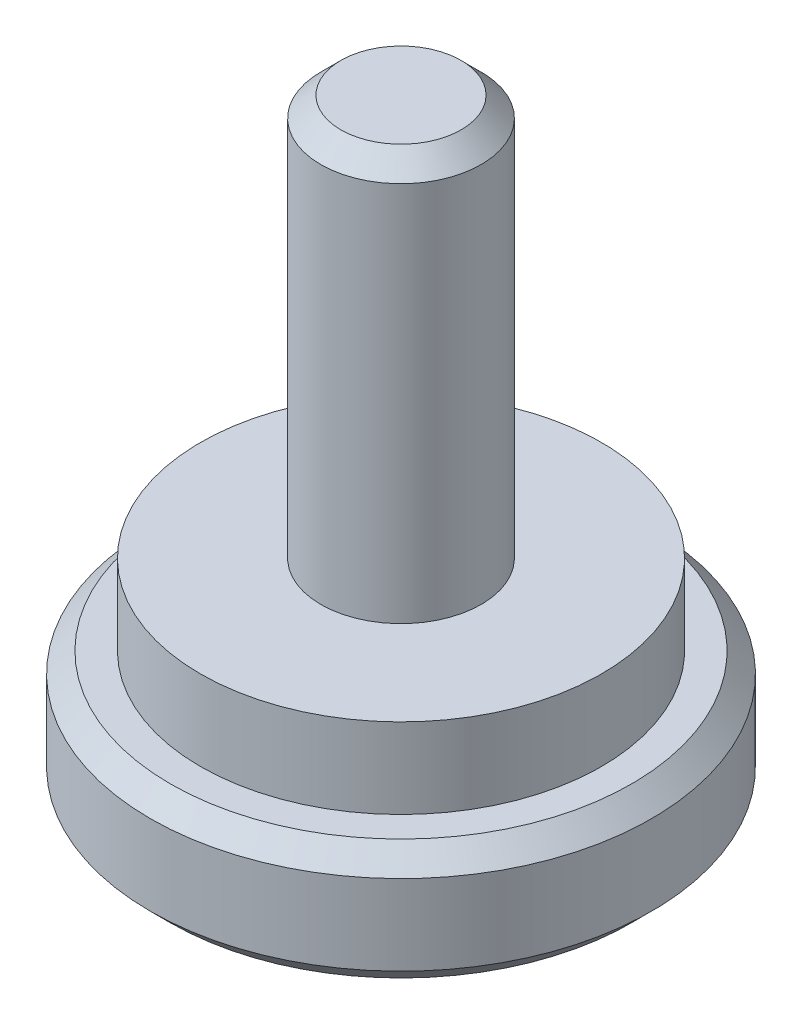
ISO-10303-21;
HEADER;
FILE_DESCRIPTION(('STEP AP214'),'2;1');
FILE_NAME('part.step','',(''),(''),'','','');
FILE_SCHEMA(('AUTOMOTIVE_DESIGN { 1 0 10303 214 1 1 1 1 }'));
ENDSEC;
DATA;
#1=APPLICATION_CONTEXT('core data for automotive mechanical design processes');
#2=APPLICATION_PROTOCOL_DEFINITION('international standard','automotive_design',2000,#1);
#3=PRODUCT_CONTEXT('',#1,'mechanical');
#4=PRODUCT('Part','Part','',(#3));
#5=PRODUCT_RELATED_PRODUCT_CATEGORY('part','',(#4));
#6=PRODUCT_DEFINITION_FORMATION('','',#4);
#7=PRODUCT_DEFINITION_CONTEXT('part definition',#1,'design');
#8=PRODUCT_DEFINITION('design','',#6,#7);
#9=PRODUCT_DEFINITION_SHAPE('','',#8);
#10=(LENGTH_UNIT() NAMED_UNIT(*) SI_UNIT(.MILLI.,.METRE.));
#11=(NAMED_UNIT(*) PLANE_ANGLE_UNIT() SI_UNIT($,.RADIAN.));
#12=(NAMED_UNIT(*) SI_UNIT($,.STERADIAN.) SOLID_ANGLE_UNIT());
#13=UNCERTAINTY_MEASURE_WITH_UNIT(LENGTH_MEASURE(1.E-05),#10,'distance_accuracy_value','');
#14=(GEOMETRIC_REPRESENTATION_CONTEXT(3) GLOBAL_UNCERTAINTY_ASSIGNED_CONTEXT((#13)) GLOBAL_UNIT_ASSIGNED_CONTEXT((#10,
#11,#12)) REPRESENTATION_CONTEXT('',''));
#15=CARTESIAN_POINT('',(0.,0.,0.));
#16=DIRECTION('',(0.,0.,1.));
#17=DIRECTION('',(1.,0.,0.));
#18=AXIS2_PLACEMENT_3D('',#15,#16,#17);
#19=CARTESIAN_POINT('',(0.,5.,0.));
#20=DIRECTION('',(0.,1.,0.));
#21=DIRECTION('',(0.,0.,1.));
#22=AXIS2_PLACEMENT_3D('',#19,#20,#21);
#23=PLANE('',#22);
#24=CARTESIAN_POINT('',(0.,5.,0.));
#25=DIRECTION('',(0.,1.,0.));
#26=DIRECTION('',(0.,0.,1.));
#27=AXIS2_PLACEMENT_3D('',#24,#25,#26);
#28=CIRCLE('',#27,5.);
#29=CARTESIAN_POINT('',(0.,5.,5.));
#30=VERTEX_POINT('',#29);
#31=EDGE_CURVE('E141',#30,#30,#28,.T.);
#32=ORIENTED_EDGE('',*,*,#31,.T.);
#33=EDGE_LOOP('',(#32));
#34=FACE_BOUND('',#33,.T.);
#35=CARTESIAN_POINT('',(0.,5.,0.));
#36=DIRECTION('',(0.,1.,0.));
#37=DIRECTION('',(0.,0.,1.));
#38=AXIS2_PLACEMENT_3D('',#35,#36,#37);
#39=CIRCLE('',#38,2.);
#40=CARTESIAN_POINT('',(0.,5.,2.));
#41=VERTEX_POINT('',#40);
#42=EDGE_CURVE('E132',#41,#41,#39,.T.);
#43=ORIENTED_EDGE('',*,*,#42,.F.);
#44=EDGE_LOOP('',(#43));
#45=FACE_BOUND('',#44,.T.);
#46=ADVANCED_FACE('F30',(#34,#45),#23,.T.);
#47=CARTESIAN_POINT('',(0.,3.,0.));
#48=DIRECTION('',(0.,1.,0.));
#49=DIRECTION('',(0.,0.,1.));
#50=AXIS2_PLACEMENT_3D('',#47,#48,#49);
#51=PLANE('',#50);
#52=CARTESIAN_POINT('',(0.,3.,0.));
#53=DIRECTION('',(0.,1.,0.));
#54=DIRECTION('',(0.,0.,1.));
#55=AXIS2_PLACEMENT_3D('',#52,#53,#54);
#56=CIRCLE('',#55,5.75);
#57=CARTESIAN_POINT('',(0.,3.,5.75));
#58=VERTEX_POINT('',#57);
#59=EDGE_CURVE('E144',#58,#58,#56,.T.);
#60=ORIENTED_EDGE('',*,*,#59,.T.);
#61=EDGE_LOOP('',(#60));
#62=FACE_BOUND('',#61,.T.);
#63=CARTESIAN_POINT('',(0.,3.,0.));
#64=DIRECTION('',(0.,1.,0.));
#65=DIRECTION('',(0.,0.,1.));
#66=AXIS2_PLACEMENT_3D('',#63,#64,#65);
#67=CIRCLE('',#66,5.);
#68=CARTESIAN_POINT('',(0.,3.,5.));
#69=VERTEX_POINT('',#68);
#70=EDGE_CURVE('E140',#69,#69,#67,.T.);
#71=ORIENTED_EDGE('',*,*,#70,.F.);
#72=EDGE_LOOP('',(#71));
#73=FACE_BOUND('',#72,.T.);
#74=ADVANCED_FACE('F176',(#62,#73),#51,.T.);
#75=CARTESIAN_POINT('',(0.,3.,0.));
#76=DIRECTION('',(0.,-1.,0.));
#77=DIRECTION('',(0.,0.,-1.));
#78=AXIS2_PLACEMENT_3D('',#75,#76,#77);
#79=CYLINDRICAL_SURFACE('',#78,6.25);
#80=CARTESIAN_POINT('',(0.,2.5,0.));
#81=DIRECTION('',(0.,1.,0.));
#82=DIRECTION('',(0.,0.,1.));
#83=AXIS2_PLACEMENT_3D('',#80,#81,#82);
#84=CIRCLE('',#83,6.25);
#85=CARTESIAN_POINT('',(0.,2.5,6.25));
#86=VERTEX_POINT('',#85);
#87=EDGE_CURVE('E152',#86,#86,#84,.F.);
#88=ORIENTED_EDGE('',*,*,#87,.T.);
#89=EDGE_LOOP('',(#88));
#90=FACE_BOUND('',#89,.T.);
#91=CARTESIAN_POINT('',(0.,0.499999999999997,0.));
#92=DIRECTION('',(0.,1.,0.));
#93=DIRECTION('',(0.,0.,1.));
#94=AXIS2_PLACEMENT_3D('',#91,#92,#93);
#95=CIRCLE('',#94,6.25);
#96=CARTESIAN_POINT('',(0.,0.499999999999997,6.25));
#97=VERTEX_POINT('',#96);
#98=EDGE_CURVE('E149',#97,#97,#95,.T.);
#99=ORIENTED_EDGE('',*,*,#98,.T.);
#100=EDGE_LOOP('',(#99));
#101=FACE_BOUND('',#100,.T.);
#102=ADVANCED_FACE('F182',(#90,#101),#79,.T.);
#103=CARTESIAN_POINT('',(0.,0.,0.));
#104=DIRECTION('',(0.,1.,0.));
#105=DIRECTION('',(0.,0.,1.));
#106=AXIS2_PLACEMENT_3D('',#103,#104,#105);
#107=PLANE('',#106);
#108=DIRECTION('',(-0.866025403784439,0.,-0.5));
#109=VECTOR('',#108,1.);
#110=CARTESIAN_POINT('',(0.,0.,2.3094010767585));
#111=LINE('',#110,#109);
#112=CARTESIAN_POINT('',(0.,0.,2.3094010767585));
#113=VERTEX_POINT('',#112);
#114=CARTESIAN_POINT('',(-2.,0.,1.15470053837925));
#115=VERTEX_POINT('',#114);
#116=EDGE_CURVE('E119',#113,#115,#111,.T.);
#117=ORIENTED_EDGE('',*,*,#116,.F.);
#118=DIRECTION('',(-0.866025403784439,0.,0.5));
#119=VECTOR('',#118,1.);
#120=CARTESIAN_POINT('',(2.,0.,1.15470053837925));
#121=LINE('',#120,#119);
#122=CARTESIAN_POINT('',(2.,0.,1.15470053837925));
#123=VERTEX_POINT('',#122);
#124=EDGE_CURVE('E45',#123,#113,#121,.T.);
#125=ORIENTED_EDGE('',*,*,#124,.F.);
#126=DIRECTION('',(0.,0.,1.));
#127=VECTOR('',#126,1.);
#128=CARTESIAN_POINT('',(2.,0.,-1.15470053837925));
#129=LINE('',#128,#127);
#130=CARTESIAN_POINT('',(2.,0.,-1.15470053837925));
#131=VERTEX_POINT('',#130);
#132=EDGE_CURVE('E128',#131,#123,#129,.T.);
#133=ORIENTED_EDGE('',*,*,#132,.F.);
#134=DIRECTION('',(0.866025403784439,0.,0.5));
#135=VECTOR('',#134,1.);
#136=CARTESIAN_POINT('',(0.,0.,-2.3094010767585));
#137=LINE('',#136,#135);
#138=CARTESIAN_POINT('',(0.,0.,-2.3094010767585));
#139=VERTEX_POINT('',#138);
#140=EDGE_CURVE('E126',#139,#131,#137,.T.);
#141=ORIENTED_EDGE('',*,*,#140,.F.);
#142=DIRECTION('',(0.866025403784439,0.,-0.5));
#143=VECTOR('',#142,1.);
#144=CARTESIAN_POINT('',(-2.,0.,-1.15470053837925));
#145=LINE('',#144,#143);
#146=CARTESIAN_POINT('',(-2.,0.,-1.15470053837925));
#147=VERTEX_POINT('',#146);
#148=EDGE_CURVE('E93',#147,#139,#145,.T.);
#149=ORIENTED_EDGE('',*,*,#148,.F.);
#150=DIRECTION('',(0.,0.,-1.));
#151=VECTOR('',#150,1.);
#152=CARTESIAN_POINT('',(-2.,0.,1.15470053837925));
#153=LINE('',#152,#151);
#154=EDGE_CURVE('E122',#115,#147,#153,.T.);
#155=ORIENTED_EDGE('',*,*,#154,.F.);
#156=EDGE_LOOP('',(#117,#125,#133,#141,#149,#155));
#157=FACE_BOUND('',#156,.T.);
#158=CARTESIAN_POINT('',(0.,0.,0.));
#159=DIRECTION('',(0.,1.,0.));
#160=DIRECTION('',(0.,0.,1.));
#161=AXIS2_PLACEMENT_3D('',#158,#159,#160);
#162=CIRCLE('',#161,5.75);
#163=CARTESIAN_POINT('',(0.,0.,5.75));
#164=VERTEX_POINT('',#163);
#165=EDGE_CURVE('E155',#164,#164,#162,.F.);
#166=ORIENTED_EDGE('',*,*,#165,.T.);
#167=EDGE_LOOP('',(#166));
#168=FACE_BOUND('',#167,.T.);
#169=ADVANCED_FACE('F192',(#157,#168),#107,.F.);
#170=CARTESIAN_POINT('',(0.,5.,0.));
#171=DIRECTION('',(0.,-1.,0.));
#172=DIRECTION('',(0.,0.,-1.));
#173=AXIS2_PLACEMENT_3D('',#170,#171,#172);
#174=CYLINDRICAL_SURFACE('',#173,5.);
#175=ORIENTED_EDGE('',*,*,#31,.F.);
#176=EDGE_LOOP('',(#175));
#177=FACE_BOUND('',#176,.T.);
#178=ORIENTED_EDGE('',*,*,#70,.T.);
#179=EDGE_LOOP('',(#178));
#180=FACE_BOUND('',#179,.T.);
#181=ADVANCED_FACE('F190',(#177,#180),#174,.T.);
#182=CARTESIAN_POINT('',(0.,15.,0.));
#183=DIRECTION('',(0.,-1.,0.));
#184=DIRECTION('',(0.,0.,-1.));
#185=AXIS2_PLACEMENT_3D('',#182,#183,#184);
#186=CYLINDRICAL_SURFACE('',#185,2.);
#187=CARTESIAN_POINT('',(0.,14.5,0.));
#188=DIRECTION('',(0.,1.,0.));
#189=DIRECTION('',(0.,0.,1.));
#190=AXIS2_PLACEMENT_3D('',#187,#188,#189);
#191=CIRCLE('',#190,2.);
#192=CARTESIAN_POINT('',(0.,14.5,2.));
#193=VERTEX_POINT('',#192);
#194=EDGE_CURVE('E11',#193,#193,#191,.F.);
#195=ORIENTED_EDGE('',*,*,#194,.T.);
#196=EDGE_LOOP('',(#195));
#197=FACE_BOUND('',#196,.T.);
#198=ORIENTED_EDGE('',*,*,#42,.T.);
#199=EDGE_LOOP('',(#198));
#200=FACE_BOUND('',#199,.T.);
#201=ADVANCED_FACE('F188',(#197,#200),#186,.T.);
#202=CARTESIAN_POINT('',(0.,15.,0.));
#203=DIRECTION('',(0.,1.,0.));
#204=DIRECTION('',(0.,0.,1.));
#205=AXIS2_PLACEMENT_3D('',#202,#203,#204);
#206=PLANE('',#205);
#207=CARTESIAN_POINT('',(0.,15.,0.));
#208=DIRECTION('',(0.,1.,0.));
#209=DIRECTION('',(0.,0.,1.));
#210=AXIS2_PLACEMENT_3D('',#207,#208,#209);
#211=CIRCLE('',#210,1.5);
#212=CARTESIAN_POINT('',(0.,15.,1.5));
#213=VERTEX_POINT('',#212);
#214=EDGE_CURVE('E38',#213,#213,#211,.T.);
#215=ORIENTED_EDGE('',*,*,#214,.T.);
#216=EDGE_LOOP('',(#215));
#217=FACE_BOUND('',#216,.T.);
#218=ADVANCED_FACE('F160',(#217),#206,.T.);
#219=CARTESIAN_POINT('',(0.,3.,0.));
#220=DIRECTION('',(0.,-1.,0.));
#221=DIRECTION('',(0.,0.,-1.));
#222=AXIS2_PLACEMENT_3D('',#219,#220,#221);
#223=CONICAL_SURFACE('',#222,5.75,0.785398163397445);
#224=ORIENTED_EDGE('',*,*,#87,.F.);
#225=EDGE_LOOP('',(#224));
#226=FACE_BOUND('',#225,.T.);
#227=ORIENTED_EDGE('',*,*,#59,.F.);
#228=EDGE_LOOP('',(#227));
#229=FACE_BOUND('',#228,.T.);
#230=ADVANCED_FACE('F172',(#226,#229),#223,.T.);
#231=CARTESIAN_POINT('',(0.,0.499999999999997,0.));
#232=DIRECTION('',(0.,1.,0.));
#233=DIRECTION('',(0.,0.,1.));
#234=AXIS2_PLACEMENT_3D('',#231,#232,#233);
#235=CONICAL_SURFACE('',#234,6.25,0.785398163397454);
#236=ORIENTED_EDGE('',*,*,#165,.F.);
#237=EDGE_LOOP('',(#236));
#238=FACE_BOUND('',#237,.T.);
#239=ORIENTED_EDGE('',*,*,#98,.F.);
#240=EDGE_LOOP('',(#239));
#241=FACE_BOUND('',#240,.T.);
#242=ADVANCED_FACE('F164',(#238,#241),#235,.T.);
#243=CARTESIAN_POINT('',(0.,15.,0.));
#244=DIRECTION('',(0.,-1.,0.));
#245=DIRECTION('',(0.,0.,-1.));
#246=AXIS2_PLACEMENT_3D('',#243,#244,#245);
#247=CONICAL_SURFACE('',#246,1.5,0.785398163397445);
#248=ORIENTED_EDGE('',*,*,#194,.F.);
#249=EDGE_LOOP('',(#248));
#250=FACE_BOUND('',#249,.T.);
#251=ORIENTED_EDGE('',*,*,#214,.F.);
#252=EDGE_LOOP('',(#251));
#253=FACE_BOUND('',#252,.T.);
#254=ADVANCED_FACE('F32',(#250,#253),#247,.T.);
#255=CARTESIAN_POINT('',(2.,4.,1.15470053837925));
#256=DIRECTION('',(0.5,0.,0.866025403784439));
#257=DIRECTION('',(0.866025403784439,0.,-0.5));
#258=AXIS2_PLACEMENT_3D('',#255,#256,#257);
#259=PLANE('',#258);
#260=ORIENTED_EDGE('',*,*,#124,.T.);
#261=DIRECTION('',(0.,-1.,0.));
#262=VECTOR('',#261,1.);
#263=CARTESIAN_POINT('',(0.,4.,2.3094010767585));
#264=LINE('',#263,#262);
#265=CARTESIAN_POINT('',(0.,4.,2.3094010767585));
#266=VERTEX_POINT('',#265);
#267=EDGE_CURVE('E75',#266,#113,#264,.T.);
#268=ORIENTED_EDGE('',*,*,#267,.F.);
#269=DIRECTION('',(-0.866025403784439,0.,0.5));
#270=VECTOR('',#269,1.);
#271=CARTESIAN_POINT('',(2.,4.,1.15470053837925));
#272=LINE('',#271,#270);
#273=CARTESIAN_POINT('',(2.,4.,1.15470053837925));
#274=VERTEX_POINT('',#273);
#275=EDGE_CURVE('E130',#274,#266,#272,.T.);
#276=ORIENTED_EDGE('',*,*,#275,.F.);
#277=DIRECTION('',(0.,-1.,0.));
#278=VECTOR('',#277,1.);
#279=CARTESIAN_POINT('',(2.,4.,1.15470053837925));
#280=LINE('',#279,#278);
#281=EDGE_CURVE('E53',#274,#123,#280,.T.);
#282=ORIENTED_EDGE('',*,*,#281,.T.);
#283=EDGE_LOOP('',(#260,#268,#276,#282));
#284=FACE_BOUND('',#283,.T.);
#285=ADVANCED_FACE('F163',(#284),#259,.F.);
#286=CARTESIAN_POINT('',(2.,4.,-1.15470053837925));
#287=DIRECTION('',(1.,0.,0.));
#288=DIRECTION('',(0.,0.,-1.));
#289=AXIS2_PLACEMENT_3D('',#286,#287,#288);
#290=PLANE('',#289);
#291=ORIENTED_EDGE('',*,*,#132,.T.);
#292=ORIENTED_EDGE('',*,*,#281,.F.);
#293=DIRECTION('',(0.,0.,1.));
#294=VECTOR('',#293,1.);
#295=CARTESIAN_POINT('',(2.,4.,-1.15470053837925));
#296=LINE('',#295,#294);
#297=CARTESIAN_POINT('',(2.,4.,-1.15470053837925));
#298=VERTEX_POINT('',#297);
#299=EDGE_CURVE('E105',#298,#274,#296,.T.);
#300=ORIENTED_EDGE('',*,*,#299,.F.);
#301=DIRECTION('',(0.,-1.,0.));
#302=VECTOR('',#301,1.);
#303=CARTESIAN_POINT('',(2.,4.,-1.15470053837925));
#304=LINE('',#303,#302);
#305=EDGE_CURVE('E97',#298,#131,#304,.T.);
#306=ORIENTED_EDGE('',*,*,#305,.T.);
#307=EDGE_LOOP('',(#291,#292,#300,#306));
#308=FACE_BOUND('',#307,.T.);
#309=ADVANCED_FACE('F170',(#308),#290,.F.);
#310=CARTESIAN_POINT('',(0.,4.,-2.3094010767585));
#311=DIRECTION('',(0.5,0.,-0.866025403784439));
#312=DIRECTION('',(-0.866025403784439,0.,-0.5));
#313=AXIS2_PLACEMENT_3D('',#310,#311,#312);
#314=PLANE('',#313);
#315=ORIENTED_EDGE('',*,*,#140,.T.);
#316=ORIENTED_EDGE('',*,*,#305,.F.);
#317=DIRECTION('',(0.866025403784439,0.,0.5));
#318=VECTOR('',#317,1.);
#319=CARTESIAN_POINT('',(0.,4.,-2.3094010767585));
#320=LINE('',#319,#318);
#321=CARTESIAN_POINT('',(0.,4.,-2.3094010767585));
#322=VERTEX_POINT('',#321);
#323=EDGE_CURVE('E101',#322,#298,#320,.T.);
#324=ORIENTED_EDGE('',*,*,#323,.F.);
#325=DIRECTION('',(0.,-1.,0.));
#326=VECTOR('',#325,1.);
#327=CARTESIAN_POINT('',(0.,4.,-2.3094010767585));
#328=LINE('',#327,#326);
#329=EDGE_CURVE('E86',#322,#139,#328,.T.);
#330=ORIENTED_EDGE('',*,*,#329,.T.);
#331=EDGE_LOOP('',(#315,#316,#324,#330));
#332=FACE_BOUND('',#331,.T.);
#333=ADVANCED_FACE('F102',(#332),#314,.F.);
#334=CARTESIAN_POINT('',(-2.,4.,-1.15470053837925));
#335=DIRECTION('',(-0.5,0.,-0.866025403784439));
#336=DIRECTION('',(-0.866025403784439,0.,0.5));
#337=AXIS2_PLACEMENT_3D('',#334,#335,#336);
#338=PLANE('',#337);
#339=ORIENTED_EDGE('',*,*,#148,.T.);
#340=ORIENTED_EDGE('',*,*,#329,.F.);
#341=DIRECTION('',(0.866025403784439,0.,-0.5));
#342=VECTOR('',#341,1.);
#343=CARTESIAN_POINT('',(-2.,4.,-1.15470053837925));
#344=LINE('',#343,#342);
#345=CARTESIAN_POINT('',(-2.,4.,-1.15470053837925));
#346=VERTEX_POINT('',#345);
#347=EDGE_CURVE('E90',#346,#322,#344,.T.);
#348=ORIENTED_EDGE('',*,*,#347,.F.);
#349=DIRECTION('',(0.,-1.,0.));
#350=VECTOR('',#349,1.);
#351=CARTESIAN_POINT('',(-2.,4.,-1.15470053837925));
#352=LINE('',#351,#350);
#353=EDGE_CURVE('E98',#346,#147,#352,.T.);
#354=ORIENTED_EDGE('',*,*,#353,.T.);
#355=EDGE_LOOP('',(#339,#340,#348,#354));
#356=FACE_BOUND('',#355,.T.);
#357=ADVANCED_FACE('F88',(#356),#338,.F.);
#358=CARTESIAN_POINT('',(-2.,4.,1.15470053837925));
#359=DIRECTION('',(-1.,0.,0.));
#360=DIRECTION('',(0.,0.,1.));
#361=AXIS2_PLACEMENT_3D('',#358,#359,#360);
#362=PLANE('',#361);
#363=ORIENTED_EDGE('',*,*,#154,.T.);
#364=ORIENTED_EDGE('',*,*,#353,.F.);
#365=DIRECTION('',(0.,0.,-1.));
#366=VECTOR('',#365,1.);
#367=CARTESIAN_POINT('',(-2.,4.,1.15470053837925));
#368=LINE('',#367,#366);
#369=CARTESIAN_POINT('',(-2.,4.,1.15470053837925));
#370=VERTEX_POINT('',#369);
#371=EDGE_CURVE('E111',#370,#346,#368,.T.);
#372=ORIENTED_EDGE('',*,*,#371,.F.);
#373=DIRECTION('',(0.,-1.,0.));
#374=VECTOR('',#373,1.);
#375=CARTESIAN_POINT('',(-2.,4.,1.15470053837925));
#376=LINE('',#375,#374);
#377=EDGE_CURVE('E135',#370,#115,#376,.T.);
#378=ORIENTED_EDGE('',*,*,#377,.T.);
#379=EDGE_LOOP('',(#363,#364,#372,#378));
#380=FACE_BOUND('',#379,.T.);
#381=ADVANCED_FACE('F223',(#380),#362,.F.);
#382=CARTESIAN_POINT('',(0.,4.,2.3094010767585));
#383=DIRECTION('',(-0.5,0.,0.866025403784439));
#384=DIRECTION('',(0.866025403784439,0.,0.5));
#385=AXIS2_PLACEMENT_3D('',#382,#383,#384);
#386=PLANE('',#385);
#387=ORIENTED_EDGE('',*,*,#116,.T.);
#388=ORIENTED_EDGE('',*,*,#377,.F.);
#389=DIRECTION('',(-0.866025403784439,0.,-0.5));
#390=VECTOR('',#389,1.);
#391=CARTESIAN_POINT('',(0.,4.,2.3094010767585));
#392=LINE('',#391,#390);
#393=EDGE_CURVE('E113',#266,#370,#392,.T.);
#394=ORIENTED_EDGE('',*,*,#393,.F.);
#395=ORIENTED_EDGE('',*,*,#267,.T.);
#396=EDGE_LOOP('',(#387,#388,#394,#395));
#397=FACE_BOUND('',#396,.T.);
#398=ADVANCED_FACE('F220',(#397),#386,.F.);
#399=CARTESIAN_POINT('',(0.,4.,2.3094010767585));
#400=DIRECTION('',(0.,-1.,0.));
#401=DIRECTION('',(0.,0.,-1.));
#402=AXIS2_PLACEMENT_3D('',#399,#400,#401);
#403=PLANE('',#402);
#404=ORIENTED_EDGE('',*,*,#275,.T.);
#405=ORIENTED_EDGE('',*,*,#393,.T.);
#406=ORIENTED_EDGE('',*,*,#371,.T.);
#407=ORIENTED_EDGE('',*,*,#347,.T.);
#408=ORIENTED_EDGE('',*,*,#323,.T.);
#409=ORIENTED_EDGE('',*,*,#299,.T.);
#410=EDGE_LOOP('',(#404,#405,#406,#407,#408,#409));
#411=FACE_BOUND('',#410,.T.);
#412=ADVANCED_FACE('F108',(#411),#403,.T.);
#413=CLOSED_SHELL('',(#46,#74,#102,#169,#181,#201,#218,#230,#242,#254,#285,#309,#333,#357,#381,
#398,#412));
#414=MANIFOLD_SOLID_BREP('B2',#413);
#415=ADVANCED_BREP_SHAPE_REPRESENTATION('',(#18,#414),#14);
#416=SHAPE_DEFINITION_REPRESENTATION(#9,#415);
ENDSEC;
END-ISO-10303-21;
